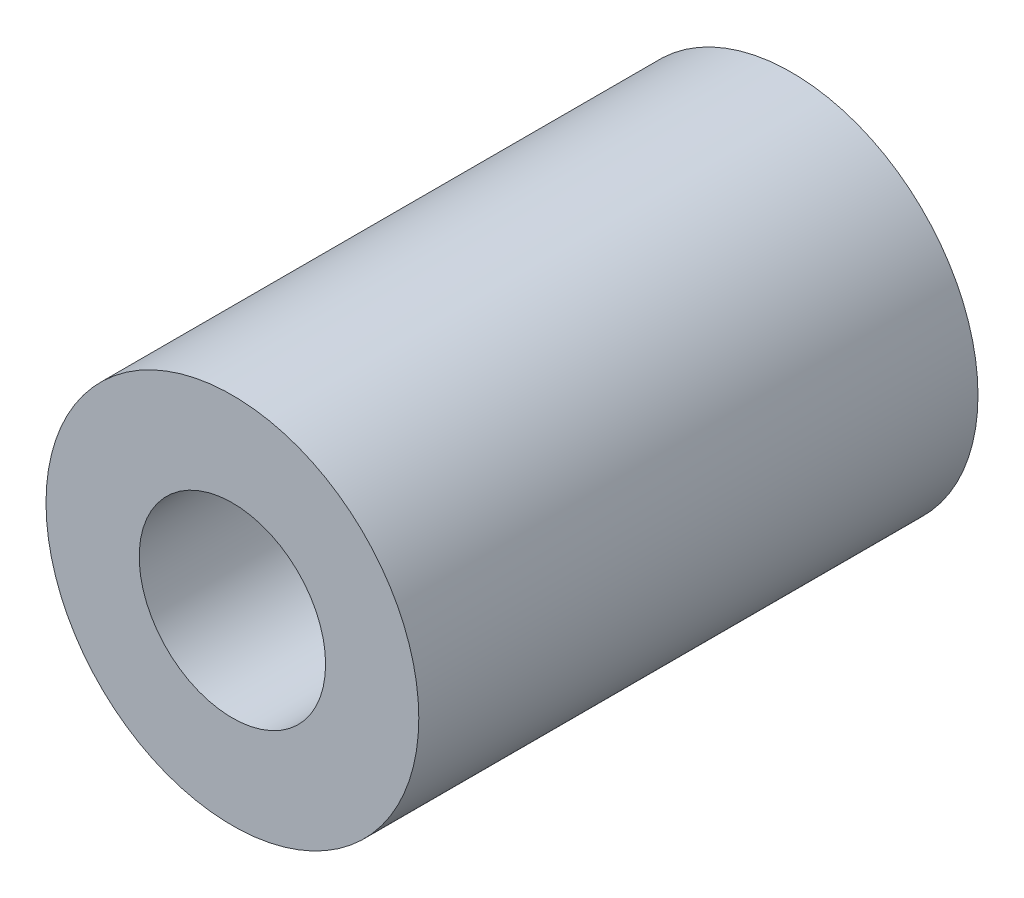
ISO-10303-21;
HEADER;
FILE_DESCRIPTION(('STEP AP214'),'2;1');
FILE_NAME('part.step','',(''),(''),'','','');
FILE_SCHEMA(('AUTOMOTIVE_DESIGN { 1 0 10303 214 1 1 1 1 }'));
ENDSEC;
DATA;
#1=APPLICATION_CONTEXT('core data for automotive mechanical design processes');
#2=APPLICATION_PROTOCOL_DEFINITION('international standard','automotive_design',2000,#1);
#3=PRODUCT_CONTEXT('',#1,'mechanical');
#4=PRODUCT('Part','Part','',(#3));
#5=PRODUCT_RELATED_PRODUCT_CATEGORY('part','',(#4));
#6=PRODUCT_DEFINITION_FORMATION('','',#4);
#7=PRODUCT_DEFINITION_CONTEXT('part definition',#1,'design');
#8=PRODUCT_DEFINITION('design','',#6,#7);
#9=PRODUCT_DEFINITION_SHAPE('','',#8);
#10=(LENGTH_UNIT() NAMED_UNIT(*) SI_UNIT(.MILLI.,.METRE.));
#11=(NAMED_UNIT(*) PLANE_ANGLE_UNIT() SI_UNIT($,.RADIAN.));
#12=(NAMED_UNIT(*) SI_UNIT($,.STERADIAN.) SOLID_ANGLE_UNIT());
#13=UNCERTAINTY_MEASURE_WITH_UNIT(LENGTH_MEASURE(1.E-05),#10,'distance_accuracy_value','');
#14=(GEOMETRIC_REPRESENTATION_CONTEXT(3) GLOBAL_UNCERTAINTY_ASSIGNED_CONTEXT((#13)) GLOBAL_UNIT_ASSIGNED_CONTEXT((#10,
#11,#12)) REPRESENTATION_CONTEXT('',''));
#15=CARTESIAN_POINT('',(0.,0.,0.));
#16=DIRECTION('',(0.,0.,1.));
#17=DIRECTION('',(1.,0.,0.));
#18=AXIS2_PLACEMENT_3D('',#15,#16,#17);
#19=CARTESIAN_POINT('',(0.,0.,6.));
#20=DIRECTION('',(0.,0.,1.));
#21=DIRECTION('',(1.,0.,0.));
#22=AXIS2_PLACEMENT_3D('',#19,#20,#21);
#23=PLANE('',#22);
#24=CARTESIAN_POINT('',(0.,0.,6.));
#25=DIRECTION('',(0.,0.,1.));
#26=DIRECTION('',(1.,0.,0.));
#27=AXIS2_PLACEMENT_3D('',#24,#25,#26);
#28=CIRCLE('',#27,2.);
#29=CARTESIAN_POINT('',(2.,0.,6.));
#30=VERTEX_POINT('',#29);
#31=EDGE_CURVE('E10',#30,#30,#28,.T.);
#32=ORIENTED_EDGE('',*,*,#31,.T.);
#33=EDGE_LOOP('',(#32));
#34=FACE_BOUND('',#33,.T.);
#35=CARTESIAN_POINT('',(0.,0.,6.));
#36=DIRECTION('',(0.,0.,1.));
#37=DIRECTION('',(1.,0.,0.));
#38=AXIS2_PLACEMENT_3D('',#35,#36,#37);
#39=CIRCLE('',#38,1.);
#40=CARTESIAN_POINT('',(1.,0.,6.));
#41=VERTEX_POINT('',#40);
#42=EDGE_CURVE('E44',#41,#41,#39,.T.);
#43=ORIENTED_EDGE('',*,*,#42,.F.);
#44=EDGE_LOOP('',(#43));
#45=FACE_BOUND('',#44,.T.);
#46=ADVANCED_FACE('F33',(#34,#45),#23,.T.);
#47=CARTESIAN_POINT('',(0.,0.,0.));
#48=DIRECTION('',(0.,0.,1.));
#49=DIRECTION('',(1.,0.,0.));
#50=AXIS2_PLACEMENT_3D('',#47,#48,#49);
#51=PLANE('',#50);
#52=CARTESIAN_POINT('',(0.,0.,0.));
#53=DIRECTION('',(0.,0.,1.));
#54=DIRECTION('',(1.,0.,0.));
#55=AXIS2_PLACEMENT_3D('',#52,#53,#54);
#56=CIRCLE('',#55,2.);
#57=CARTESIAN_POINT('',(2.,0.,0.));
#58=VERTEX_POINT('',#57);
#59=EDGE_CURVE('E37',#58,#58,#56,.T.);
#60=ORIENTED_EDGE('',*,*,#59,.F.);
#61=EDGE_LOOP('',(#60));
#62=FACE_BOUND('',#61,.T.);
#63=CARTESIAN_POINT('',(0.,0.,0.));
#64=DIRECTION('',(0.,0.,1.));
#65=DIRECTION('',(1.,0.,0.));
#66=AXIS2_PLACEMENT_3D('',#63,#64,#65);
#67=CIRCLE('',#66,1.);
#68=CARTESIAN_POINT('',(1.,0.,0.));
#69=VERTEX_POINT('',#68);
#70=EDGE_CURVE('E46',#69,#69,#67,.T.);
#71=ORIENTED_EDGE('',*,*,#70,.T.);
#72=EDGE_LOOP('',(#71));
#73=FACE_BOUND('',#72,.T.);
#74=ADVANCED_FACE('F56',(#62,#73),#51,.F.);
#75=CARTESIAN_POINT('',(0.,0.,6.));
#76=DIRECTION('',(0.,0.,-1.));
#77=DIRECTION('',(-1.,0.,0.));
#78=AXIS2_PLACEMENT_3D('',#75,#76,#77);
#79=CYLINDRICAL_SURFACE('',#78,2.);
#80=ORIENTED_EDGE('',*,*,#31,.F.);
#81=EDGE_LOOP('',(#80));
#82=FACE_BOUND('',#81,.T.);
#83=ORIENTED_EDGE('',*,*,#59,.T.);
#84=EDGE_LOOP('',(#83));
#85=FACE_BOUND('',#84,.T.);
#86=ADVANCED_FACE('F35',(#82,#85),#79,.T.);
#87=CARTESIAN_POINT('',(0.,0.,6.));
#88=DIRECTION('',(0.,0.,-1.));
#89=DIRECTION('',(-1.,0.,0.));
#90=AXIS2_PLACEMENT_3D('',#87,#88,#89);
#91=CYLINDRICAL_SURFACE('',#90,1.);
#92=ORIENTED_EDGE('',*,*,#42,.T.);
#93=EDGE_LOOP('',(#92));
#94=FACE_BOUND('',#93,.T.);
#95=ORIENTED_EDGE('',*,*,#70,.F.);
#96=EDGE_LOOP('',(#95));
#97=FACE_BOUND('',#96,.T.);
#98=ADVANCED_FACE('F52',(#94,#97),#91,.F.);
#99=CLOSED_SHELL('',(#46,#74,#86,#98));
#100=MANIFOLD_SOLID_BREP('B2',#99);
#101=ADVANCED_BREP_SHAPE_REPRESENTATION('',(#18,#100),#14);
#102=SHAPE_DEFINITION_REPRESENTATION(#9,#101);
ENDSEC;
END-ISO-10303-21;
